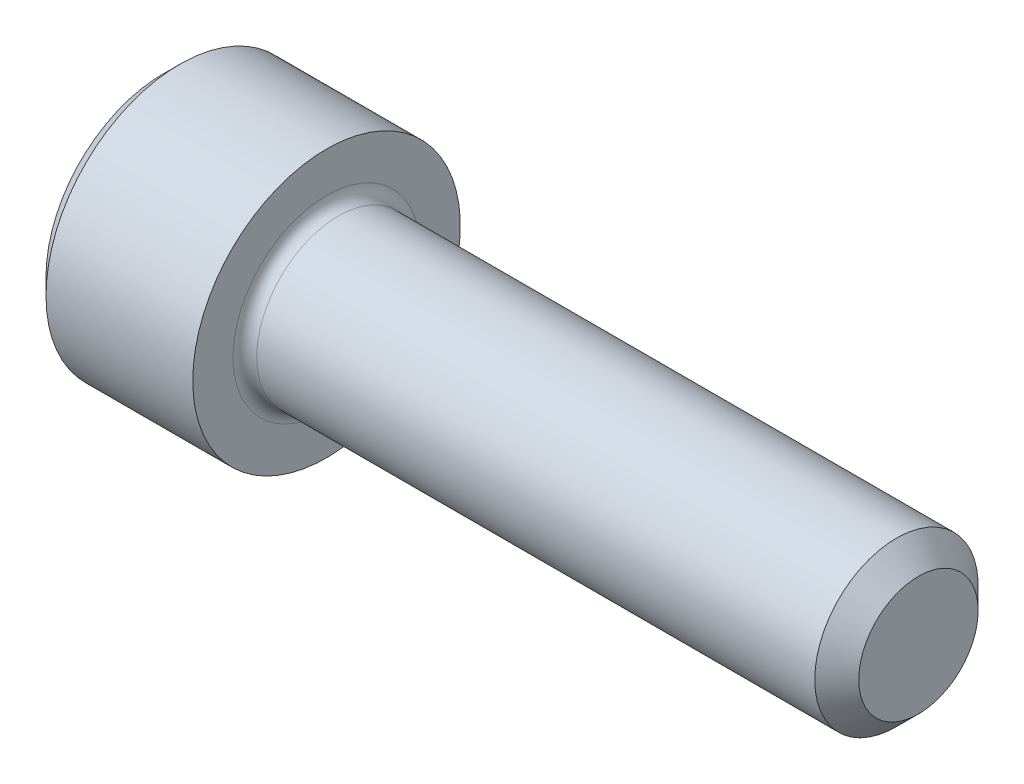
ISO-10303-21;
HEADER;
FILE_DESCRIPTION(('STEP AP214'),'2;1');
FILE_NAME('part.step','',(''),(''),'','','');
FILE_SCHEMA(('AUTOMOTIVE_DESIGN { 1 0 10303 214 1 1 1 1 }'));
ENDSEC;
DATA;
#1=APPLICATION_CONTEXT('core data for automotive mechanical design processes');
#2=APPLICATION_PROTOCOL_DEFINITION('international standard','automotive_design',2000,#1);
#3=PRODUCT_CONTEXT('',#1,'mechanical');
#4=PRODUCT('Part','Part','',(#3));
#5=PRODUCT_RELATED_PRODUCT_CATEGORY('part','',(#4));
#6=PRODUCT_DEFINITION_FORMATION('','',#4);
#7=PRODUCT_DEFINITION_CONTEXT('part definition',#1,'design');
#8=PRODUCT_DEFINITION('design','',#6,#7);
#9=PRODUCT_DEFINITION_SHAPE('','',#8);
#10=(LENGTH_UNIT() NAMED_UNIT(*) SI_UNIT(.MILLI.,.METRE.));
#11=(NAMED_UNIT(*) PLANE_ANGLE_UNIT() SI_UNIT($,.RADIAN.));
#12=(NAMED_UNIT(*) SI_UNIT($,.STERADIAN.) SOLID_ANGLE_UNIT());
#13=UNCERTAINTY_MEASURE_WITH_UNIT(LENGTH_MEASURE(1.E-05),#10,'distance_accuracy_value','');
#14=(GEOMETRIC_REPRESENTATION_CONTEXT(3) GLOBAL_UNCERTAINTY_ASSIGNED_CONTEXT((#13)) GLOBAL_UNIT_ASSIGNED_CONTEXT((#10,
#11,#12)) REPRESENTATION_CONTEXT('',''));
#15=CARTESIAN_POINT('',(0.,0.,0.));
#16=DIRECTION('',(0.,0.,1.));
#17=DIRECTION('',(1.,0.,0.));
#18=AXIS2_PLACEMENT_3D('',#15,#16,#17);
#19=CARTESIAN_POINT('',(0.,0.,0.));
#20=DIRECTION('',(-1.,0.,0.));
#21=DIRECTION('',(0.,0.,1.));
#22=AXIS2_PLACEMENT_3D('',#19,#20,#21);
#23=PLANE('',#22);
#24=DIRECTION('',(0.,-0.499999999999999,0.866025403784439));
#25=VECTOR('',#24,1.);
#26=CARTESIAN_POINT('',(0.,1.5984519552784,0.));
#27=LINE('',#26,#25);
#28=CARTESIAN_POINT('',(0.,1.5984519552784,0.));
#29=VERTEX_POINT('',#28);
#30=CARTESIAN_POINT('',(0.,0.799225977639205,1.3843));
#31=VERTEX_POINT('',#30);
#32=EDGE_CURVE('E257',#29,#31,#27,.T.);
#33=ORIENTED_EDGE('',*,*,#32,.T.);
#34=DIRECTION('',(0.,1.,0.));
#35=VECTOR('',#34,1.);
#36=CARTESIAN_POINT('',(0.,-0.799225977639191,1.3843));
#37=LINE('',#36,#35);
#38=CARTESIAN_POINT('',(0.,-0.799225977639191,1.3843));
#39=VERTEX_POINT('',#38);
#40=EDGE_CURVE('E128',#39,#31,#37,.T.);
#41=ORIENTED_EDGE('',*,*,#40,.F.);
#42=DIRECTION('',(0.,-0.500000000000001,-0.866025403784438));
#43=VECTOR('',#42,1.);
#44=CARTESIAN_POINT('',(0.,-0.799225977639191,1.3843));
#45=LINE('',#44,#43);
#46=CARTESIAN_POINT('',(0.,-1.59845195527839,0.));
#47=VERTEX_POINT('',#46);
#48=EDGE_CURVE('E260',#39,#47,#45,.T.);
#49=ORIENTED_EDGE('',*,*,#48,.T.);
#50=DIRECTION('',(0.,0.499999999999999,-0.86602540378444));
#51=VECTOR('',#50,1.);
#52=CARTESIAN_POINT('',(0.,-1.59845195527839,0.));
#53=LINE('',#52,#51);
#54=CARTESIAN_POINT('',(0.,-0.799225977639196,-1.3843));
#55=VERTEX_POINT('',#54);
#56=EDGE_CURVE('E263',#47,#55,#53,.T.);
#57=ORIENTED_EDGE('',*,*,#56,.T.);
#58=DIRECTION('',(0.,-1.,0.));
#59=VECTOR('',#58,1.);
#60=CARTESIAN_POINT('',(0.,0.799225977639202,-1.3843));
#61=LINE('',#60,#59);
#62=CARTESIAN_POINT('',(0.,0.799225977639202,-1.3843));
#63=VERTEX_POINT('',#62);
#64=EDGE_CURVE('E266',#63,#55,#61,.T.);
#65=ORIENTED_EDGE('',*,*,#64,.F.);
#66=DIRECTION('',(0.,-0.500000000000001,-0.866025403784438));
#67=VECTOR('',#66,1.);
#68=CARTESIAN_POINT('',(0.,1.5984519552784,0.));
#69=LINE('',#68,#67);
#70=EDGE_CURVE('E123',#29,#63,#69,.T.);
#71=ORIENTED_EDGE('',*,*,#70,.F.);
#72=EDGE_LOOP('',(#33,#41,#49,#57,#65,#71));
#73=FACE_BOUND('',#72,.T.);
#74=CARTESIAN_POINT('',(0.,0.,0.));
#75=DIRECTION('',(-1.,0.,0.));
#76=DIRECTION('',(0.,0.,1.));
#77=AXIS2_PLACEMENT_3D('',#74,#75,#76);
#78=CIRCLE('',#77,2.51460000000001);
#79=CARTESIAN_POINT('',(0.,0.,2.51460000000001));
#80=VERTEX_POINT('',#79);
#81=EDGE_CURVE('E152',#80,#80,#78,.T.);
#82=ORIENTED_EDGE('',*,*,#81,.T.);
#83=EDGE_LOOP('',(#82));
#84=FACE_BOUND('',#83,.T.);
#85=ADVANCED_FACE('F32',(#73,#84),#23,.T.);
#86=CARTESIAN_POINT('',(0.,0.,0.));
#87=DIRECTION('',(1.,0.,0.));
#88=DIRECTION('',(0.,0.,-1.));
#89=AXIS2_PLACEMENT_3D('',#86,#87,#88);
#90=CONICAL_SURFACE('',#89,2.51460000000001,0.785398163397436);
#91=CARTESIAN_POINT('',(0.355600000000005,0.,0.));
#92=DIRECTION('',(-1.,0.,0.));
#93=DIRECTION('',(0.,0.,1.));
#94=AXIS2_PLACEMENT_3D('',#91,#92,#93);
#95=CIRCLE('',#94,2.8702);
#96=CARTESIAN_POINT('',(0.355600000000005,0.,2.8702));
#97=VERTEX_POINT('',#96);
#98=EDGE_CURVE('E149',#97,#97,#95,.T.);
#99=ORIENTED_EDGE('',*,*,#98,.T.);
#100=EDGE_LOOP('',(#99));
#101=FACE_BOUND('',#100,.T.);
#102=ORIENTED_EDGE('',*,*,#81,.F.);
#103=EDGE_LOOP('',(#102));
#104=FACE_BOUND('',#103,.T.);
#105=ADVANCED_FACE('F173',(#101,#104),#90,.T.);
#106=CARTESIAN_POINT('',(-31.75,0.,0.));
#107=DIRECTION('',(-1.,0.,0.));
#108=DIRECTION('',(0.,0.,1.));
#109=AXIS2_PLACEMENT_3D('',#106,#107,#108);
#110=CYLINDRICAL_SURFACE('',#109,2.8702);
#111=CARTESIAN_POINT('',(3.5052,0.,0.));
#112=DIRECTION('',(-1.,0.,0.));
#113=DIRECTION('',(0.,0.,1.));
#114=AXIS2_PLACEMENT_3D('',#111,#112,#113);
#115=CIRCLE('',#114,2.8702);
#116=CARTESIAN_POINT('',(3.5052,0.,2.8702));
#117=VERTEX_POINT('',#116);
#118=EDGE_CURVE('E146',#117,#117,#115,.T.);
#119=ORIENTED_EDGE('',*,*,#118,.T.);
#120=EDGE_LOOP('',(#119));
#121=FACE_BOUND('',#120,.T.);
#122=ORIENTED_EDGE('',*,*,#98,.F.);
#123=EDGE_LOOP('',(#122));
#124=FACE_BOUND('',#123,.T.);
#125=ADVANCED_FACE('F178',(#121,#124),#110,.T.);
#126=CARTESIAN_POINT('',(3.5052,2.8702,0.));
#127=DIRECTION('',(1.,0.,0.));
#128=DIRECTION('',(0.,0.,-1.));
#129=AXIS2_PLACEMENT_3D('',#126,#127,#128);
#130=PLANE('',#129);
#131=CARTESIAN_POINT('',(3.5052,0.,0.));
#132=DIRECTION('',(1.,0.,0.));
#133=DIRECTION('',(0.,0.,-1.));
#134=AXIS2_PLACEMENT_3D('',#131,#132,#133);
#135=CIRCLE('',#134,2.0066);
#136=CARTESIAN_POINT('',(3.5052,0.,-2.0066));
#137=VERTEX_POINT('',#136);
#138=EDGE_CURVE('E40',#137,#137,#135,.F.);
#139=ORIENTED_EDGE('',*,*,#138,.T.);
#140=EDGE_LOOP('',(#139));
#141=FACE_BOUND('',#140,.T.);
#142=ORIENTED_EDGE('',*,*,#118,.F.);
#143=EDGE_LOOP('',(#142));
#144=FACE_BOUND('',#143,.T.);
#145=ADVANCED_FACE('F157',(#141,#144),#130,.T.);
#146=CARTESIAN_POINT('',(-31.75,0.,0.));
#147=DIRECTION('',(-1.,0.,0.));
#148=DIRECTION('',(0.,0.,1.));
#149=AXIS2_PLACEMENT_3D('',#146,#147,#148);
#150=CYLINDRICAL_SURFACE('',#149,1.7526);
#151=CARTESIAN_POINT('',(3.7592,0.,0.));
#152=DIRECTION('',(1.,0.,0.));
#153=DIRECTION('',(0.,0.,-1.));
#154=AXIS2_PLACEMENT_3D('',#151,#152,#153);
#155=CIRCLE('',#154,1.7526);
#156=CARTESIAN_POINT('',(3.7592,0.,-1.7526));
#157=VERTEX_POINT('',#156);
#158=EDGE_CURVE('E11',#157,#157,#155,.T.);
#159=ORIENTED_EDGE('',*,*,#158,.T.);
#160=EDGE_LOOP('',(#159));
#161=FACE_BOUND('',#160,.T.);
#162=CARTESIAN_POINT('',(15.73276,0.,0.));
#163=DIRECTION('',(-1.,0.,0.));
#164=DIRECTION('',(0.,0.,1.));
#165=AXIS2_PLACEMENT_3D('',#162,#163,#164);
#166=CIRCLE('',#165,1.7526);
#167=CARTESIAN_POINT('',(15.73276,0.,1.7526));
#168=VERTEX_POINT('',#167);
#169=EDGE_CURVE('E143',#168,#168,#166,.T.);
#170=ORIENTED_EDGE('',*,*,#169,.T.);
#171=EDGE_LOOP('',(#170));
#172=FACE_BOUND('',#171,.T.);
#173=ADVANCED_FACE('F188',(#161,#172),#150,.T.);
#174=CARTESIAN_POINT('',(16.2052,0.,0.));
#175=DIRECTION('',(-1.,0.,0.));
#176=DIRECTION('',(0.,0.,1.));
#177=AXIS2_PLACEMENT_3D('',#174,#175,#176);
#178=CONICAL_SURFACE('',#177,1.28016,0.785398163397457);
#179=ORIENTED_EDGE('',*,*,#169,.F.);
#180=EDGE_LOOP('',(#179));
#181=FACE_BOUND('',#180,.T.);
#182=CARTESIAN_POINT('',(16.2052,0.,0.));
#183=DIRECTION('',(-1.,0.,0.));
#184=DIRECTION('',(0.,0.,1.));
#185=AXIS2_PLACEMENT_3D('',#182,#183,#184);
#186=CIRCLE('',#185,1.28016);
#187=CARTESIAN_POINT('',(16.2052,0.,1.28016));
#188=VERTEX_POINT('',#187);
#189=EDGE_CURVE('E139',#188,#188,#186,.T.);
#190=ORIENTED_EDGE('',*,*,#189,.T.);
#191=EDGE_LOOP('',(#190));
#192=FACE_BOUND('',#191,.T.);
#193=ADVANCED_FACE('F168',(#181,#192),#178,.T.);
#194=CARTESIAN_POINT('',(16.2052,1.28016,0.));
#195=DIRECTION('',(1.,0.,0.));
#196=DIRECTION('',(0.,0.,-1.));
#197=AXIS2_PLACEMENT_3D('',#194,#195,#196);
#198=PLANE('',#197);
#199=ORIENTED_EDGE('',*,*,#189,.F.);
#200=EDGE_LOOP('',(#199));
#201=FACE_BOUND('',#200,.T.);
#202=ADVANCED_FACE('F161',(#201),#198,.T.);
#203=CARTESIAN_POINT('',(3.7592,0.,0.));
#204=DIRECTION('',(1.,0.,0.));
#205=DIRECTION('',(0.,0.,-1.));
#206=AXIS2_PLACEMENT_3D('',#203,#204,#205);
#207=TOROIDAL_SURFACE('',#206,2.0066,0.254);
#208=ORIENTED_EDGE('',*,*,#158,.F.);
#209=EDGE_LOOP('',(#208));
#210=FACE_BOUND('',#209,.T.);
#211=ORIENTED_EDGE('',*,*,#138,.F.);
#212=EDGE_LOOP('',(#211));
#213=FACE_BOUND('',#212,.T.);
#214=ADVANCED_FACE('F34',(#210,#213),#207,.F.);
#215=CARTESIAN_POINT('',(1.6256,1.5984519552784,0.));
#216=DIRECTION('',(0.,-0.866025403784439,-0.499999999999999));
#217=DIRECTION('',(0.,0.499999999999999,-0.866025403784439));
#218=AXIS2_PLACEMENT_3D('',#215,#216,#217);
#219=PLANE('',#218);
#220=ORIENTED_EDGE('',*,*,#32,.F.);
#221=DIRECTION('',(-1.,0.,0.));
#222=VECTOR('',#221,1.);
#223=CARTESIAN_POINT('',(1.6256,1.5984519552784,0.));
#224=LINE('',#223,#222);
#225=CARTESIAN_POINT('',(1.6256,1.5984519552784,0.));
#226=VERTEX_POINT('',#225);
#227=EDGE_CURVE('E247',#226,#29,#224,.T.);
#228=ORIENTED_EDGE('',*,*,#227,.F.);
#229=DIRECTION('',(0.,-0.499999999999999,0.866025403784439));
#230=VECTOR('',#229,1.);
#231=CARTESIAN_POINT('',(1.6256,1.5984519552784,0.));
#232=LINE('',#231,#230);
#233=CARTESIAN_POINT('',(1.6256,1.1988389664588,0.692150000000001));
#234=VERTEX_POINT('',#233);
#235=EDGE_CURVE('E115',#226,#234,#232,.T.);
#236=ORIENTED_EDGE('',*,*,#235,.T.);
#237=CARTESIAN_POINT('',(1.6256,0.799225977639205,1.3843));
#238=VERTEX_POINT('',#237);
#239=EDGE_CURVE('E106',#234,#238,#232,.T.);
#240=ORIENTED_EDGE('',*,*,#239,.T.);
#241=DIRECTION('',(-1.,0.,0.));
#242=VECTOR('',#241,1.);
#243=CARTESIAN_POINT('',(1.6256,0.799225977639205,1.3843));
#244=LINE('',#243,#242);
#245=EDGE_CURVE('E120',#238,#31,#244,.T.);
#246=ORIENTED_EDGE('',*,*,#245,.T.);
#247=EDGE_LOOP('',(#220,#228,#236,#240,#246));
#248=FACE_BOUND('',#247,.T.);
#249=ADVANCED_FACE('F119',(#248),#219,.T.);
#250=CARTESIAN_POINT('',(1.6256,-0.799225977639191,1.3843));
#251=DIRECTION('',(0.,0.,1.));
#252=DIRECTION('',(0.,-1.,0.));
#253=AXIS2_PLACEMENT_3D('',#250,#251,#252);
#254=PLANE('',#253);
#255=ORIENTED_EDGE('',*,*,#40,.T.);
#256=ORIENTED_EDGE('',*,*,#245,.F.);
#257=DIRECTION('',(0.,1.,0.));
#258=VECTOR('',#257,1.);
#259=CARTESIAN_POINT('',(1.6256,-0.799225977639191,1.3843));
#260=LINE('',#259,#258);
#261=CARTESIAN_POINT('',(1.6256,0.,1.3843));
#262=VERTEX_POINT('',#261);
#263=EDGE_CURVE('E103',#262,#238,#260,.T.);
#264=ORIENTED_EDGE('',*,*,#263,.F.);
#265=CARTESIAN_POINT('',(1.6256,-0.799225977639191,1.3843));
#266=VERTEX_POINT('',#265);
#267=EDGE_CURVE('E114',#266,#262,#260,.T.);
#268=ORIENTED_EDGE('',*,*,#267,.F.);
#269=DIRECTION('',(-1.,0.,0.));
#270=VECTOR('',#269,1.);
#271=CARTESIAN_POINT('',(1.6256,-0.799225977639191,1.3843));
#272=LINE('',#271,#270);
#273=EDGE_CURVE('E130',#266,#39,#272,.T.);
#274=ORIENTED_EDGE('',*,*,#273,.T.);
#275=EDGE_LOOP('',(#255,#256,#264,#268,#274));
#276=FACE_BOUND('',#275,.T.);
#277=ADVANCED_FACE('F125',(#276),#254,.F.);
#278=CARTESIAN_POINT('',(1.6256,-0.799225977639191,1.3843));
#279=DIRECTION('',(0.,0.866025403784438,-0.500000000000001));
#280=DIRECTION('',(0.,0.500000000000001,0.866025403784438));
#281=AXIS2_PLACEMENT_3D('',#278,#279,#280);
#282=PLANE('',#281);
#283=ORIENTED_EDGE('',*,*,#48,.F.);
#284=ORIENTED_EDGE('',*,*,#273,.F.);
#285=DIRECTION('',(0.,-0.500000000000001,-0.866025403784438));
#286=VECTOR('',#285,1.);
#287=CARTESIAN_POINT('',(1.6256,-0.799225977639191,1.3843));
#288=LINE('',#287,#286);
#289=CARTESIAN_POINT('',(1.6256,-1.19883896645879,0.692149999999999));
#290=VERTEX_POINT('',#289);
#291=EDGE_CURVE('E286',#266,#290,#288,.T.);
#292=ORIENTED_EDGE('',*,*,#291,.T.);
#293=CARTESIAN_POINT('',(1.6256,-1.59845195527839,0.));
#294=VERTEX_POINT('',#293);
#295=EDGE_CURVE('E275',#290,#294,#288,.T.);
#296=ORIENTED_EDGE('',*,*,#295,.T.);
#297=DIRECTION('',(-1.,0.,0.));
#298=VECTOR('',#297,1.);
#299=CARTESIAN_POINT('',(1.6256,-1.59845195527839,0.));
#300=LINE('',#299,#298);
#301=EDGE_CURVE('E135',#294,#47,#300,.T.);
#302=ORIENTED_EDGE('',*,*,#301,.T.);
#303=EDGE_LOOP('',(#283,#284,#292,#296,#302));
#304=FACE_BOUND('',#303,.T.);
#305=ADVANCED_FACE('F201',(#304),#282,.T.);
#306=CARTESIAN_POINT('',(1.6256,-1.59845195527839,0.));
#307=DIRECTION('',(0.,0.866025403784439,0.499999999999999));
#308=DIRECTION('',(0.,-0.499999999999999,0.866025403784439));
#309=AXIS2_PLACEMENT_3D('',#306,#307,#308);
#310=PLANE('',#309);
#311=ORIENTED_EDGE('',*,*,#56,.F.);
#312=ORIENTED_EDGE('',*,*,#301,.F.);
#313=DIRECTION('',(0.,0.499999999999999,-0.86602540378444));
#314=VECTOR('',#313,1.);
#315=CARTESIAN_POINT('',(1.6256,-1.59845195527839,0.));
#316=LINE('',#315,#314);
#317=CARTESIAN_POINT('',(1.6256,-1.1988389664588,-0.692149999999996));
#318=VERTEX_POINT('',#317);
#319=EDGE_CURVE('E253',#294,#318,#316,.T.);
#320=ORIENTED_EDGE('',*,*,#319,.T.);
#321=CARTESIAN_POINT('',(1.6256,-0.799225977639196,-1.3843));
#322=VERTEX_POINT('',#321);
#323=EDGE_CURVE('E285',#318,#322,#316,.T.);
#324=ORIENTED_EDGE('',*,*,#323,.T.);
#325=DIRECTION('',(-1.,0.,0.));
#326=VECTOR('',#325,1.);
#327=CARTESIAN_POINT('',(1.6256,-0.799225977639196,-1.3843));
#328=LINE('',#327,#326);
#329=EDGE_CURVE('E246',#322,#55,#328,.T.);
#330=ORIENTED_EDGE('',*,*,#329,.T.);
#331=EDGE_LOOP('',(#311,#312,#320,#324,#330));
#332=FACE_BOUND('',#331,.T.);
#333=ADVANCED_FACE('F204',(#332),#310,.T.);
#334=CARTESIAN_POINT('',(1.6256,0.799225977639202,-1.3843));
#335=DIRECTION('',(0.,0.,-1.));
#336=DIRECTION('',(0.,1.,0.));
#337=AXIS2_PLACEMENT_3D('',#334,#335,#336);
#338=PLANE('',#337);
#339=ORIENTED_EDGE('',*,*,#64,.T.);
#340=ORIENTED_EDGE('',*,*,#329,.F.);
#341=DIRECTION('',(0.,-1.,0.));
#342=VECTOR('',#341,1.);
#343=CARTESIAN_POINT('',(1.6256,0.799225977639202,-1.3843));
#344=LINE('',#343,#342);
#345=CARTESIAN_POINT('',(1.6256,0.,-1.3843));
#346=VERTEX_POINT('',#345);
#347=EDGE_CURVE('E250',#346,#322,#344,.T.);
#348=ORIENTED_EDGE('',*,*,#347,.F.);
#349=CARTESIAN_POINT('',(1.6256,0.799225977639202,-1.3843));
#350=VERTEX_POINT('',#349);
#351=EDGE_CURVE('E47',#350,#346,#344,.T.);
#352=ORIENTED_EDGE('',*,*,#351,.F.);
#353=DIRECTION('',(-1.,0.,0.));
#354=VECTOR('',#353,1.);
#355=CARTESIAN_POINT('',(1.6256,0.799225977639202,-1.3843));
#356=LINE('',#355,#354);
#357=EDGE_CURVE('E243',#350,#63,#356,.T.);
#358=ORIENTED_EDGE('',*,*,#357,.T.);
#359=EDGE_LOOP('',(#339,#340,#348,#352,#358));
#360=FACE_BOUND('',#359,.T.);
#361=ADVANCED_FACE('F208',(#360),#338,.F.);
#362=CARTESIAN_POINT('',(1.6256,1.5984519552784,0.));
#363=DIRECTION('',(0.,0.866025403784438,-0.500000000000001));
#364=DIRECTION('',(0.,0.500000000000001,0.866025403784438));
#365=AXIS2_PLACEMENT_3D('',#362,#363,#364);
#366=PLANE('',#365);
#367=ORIENTED_EDGE('',*,*,#70,.T.);
#368=ORIENTED_EDGE('',*,*,#357,.F.);
#369=DIRECTION('',(0.,-0.500000000000001,-0.866025403784438));
#370=VECTOR('',#369,1.);
#371=CARTESIAN_POINT('',(1.6256,1.5984519552784,0.));
#372=LINE('',#371,#370);
#373=CARTESIAN_POINT('',(1.6256,1.1988389664588,-0.692150000000004));
#374=VERTEX_POINT('',#373);
#375=EDGE_CURVE('E233',#374,#350,#372,.T.);
#376=ORIENTED_EDGE('',*,*,#375,.F.);
#377=EDGE_CURVE('E239',#226,#374,#372,.T.);
#378=ORIENTED_EDGE('',*,*,#377,.F.);
#379=ORIENTED_EDGE('',*,*,#227,.T.);
#380=EDGE_LOOP('',(#367,#368,#376,#378,#379));
#381=FACE_BOUND('',#380,.T.);
#382=ADVANCED_FACE('F212',(#381),#366,.F.);
#383=CARTESIAN_POINT('',(1.6256,0.,2.7686));
#384=DIRECTION('',(1.,0.,0.));
#385=DIRECTION('',(0.,0.,-1.));
#386=AXIS2_PLACEMENT_3D('',#383,#384,#385);
#387=PLANE('',#386);
#388=ORIENTED_EDGE('',*,*,#347,.T.);
#389=ORIENTED_EDGE('',*,*,#323,.F.);
#390=CARTESIAN_POINT('',(1.6256,0.,0.));
#391=DIRECTION('',(-1.,0.,0.));
#392=DIRECTION('',(0.,0.,1.));
#393=AXIS2_PLACEMENT_3D('',#390,#391,#392);
#394=CIRCLE('',#393,1.3843);
#395=EDGE_CURVE('E281',#346,#318,#394,.T.);
#396=ORIENTED_EDGE('',*,*,#395,.F.);
#397=EDGE_LOOP('',(#388,#389,#396));
#398=FACE_BOUND('',#397,.T.);
#399=ADVANCED_FACE('F216',(#398),#387,.F.);
#400=ORIENTED_EDGE('',*,*,#319,.F.);
#401=ORIENTED_EDGE('',*,*,#295,.F.);
#402=EDGE_CURVE('E133',#318,#290,#394,.T.);
#403=ORIENTED_EDGE('',*,*,#402,.F.);
#404=EDGE_LOOP('',(#400,#401,#403));
#405=FACE_BOUND('',#404,.T.);
#406=ADVANCED_FACE('F219',(#405),#387,.F.);
#407=ORIENTED_EDGE('',*,*,#291,.F.);
#408=ORIENTED_EDGE('',*,*,#267,.T.);
#409=EDGE_CURVE('E129',#290,#262,#394,.T.);
#410=ORIENTED_EDGE('',*,*,#409,.F.);
#411=EDGE_LOOP('',(#407,#408,#410));
#412=FACE_BOUND('',#411,.T.);
#413=ADVANCED_FACE('F224',(#412),#387,.F.);
#414=ORIENTED_EDGE('',*,*,#263,.T.);
#415=ORIENTED_EDGE('',*,*,#239,.F.);
#416=EDGE_CURVE('E109',#262,#234,#394,.T.);
#417=ORIENTED_EDGE('',*,*,#416,.F.);
#418=EDGE_LOOP('',(#414,#415,#417));
#419=FACE_BOUND('',#418,.T.);
#420=ADVANCED_FACE('F105',(#419),#387,.F.);
#421=ORIENTED_EDGE('',*,*,#235,.F.);
#422=ORIENTED_EDGE('',*,*,#377,.T.);
#423=EDGE_CURVE('E140',#234,#374,#394,.T.);
#424=ORIENTED_EDGE('',*,*,#423,.F.);
#425=EDGE_LOOP('',(#421,#422,#424));
#426=FACE_BOUND('',#425,.T.);
#427=ADVANCED_FACE('F227',(#426),#387,.F.);
#428=ORIENTED_EDGE('',*,*,#375,.T.);
#429=ORIENTED_EDGE('',*,*,#351,.T.);
#430=EDGE_CURVE('E236',#374,#346,#394,.T.);
#431=ORIENTED_EDGE('',*,*,#430,.F.);
#432=EDGE_LOOP('',(#428,#429,#431));
#433=FACE_BOUND('',#432,.T.);
#434=ADVANCED_FACE('F197',(#433),#387,.F.);
#435=CARTESIAN_POINT('',(1.6256,0.,0.));
#436=DIRECTION('',(-1.,0.,0.));
#437=DIRECTION('',(0.,0.,1.));
#438=AXIS2_PLACEMENT_3D('',#435,#436,#437);
#439=CONICAL_SURFACE('',#438,1.3843,1.04719755119659);
#440=CARTESIAN_POINT('',(2.4248259776392,0.,0.));
#441=VERTEX_POINT('',#440);
#442=VERTEX_LOOP('',#441);
#443=FACE_BOUND('',#442,.T.);
#444=ORIENTED_EDGE('',*,*,#416,.T.);
#445=ORIENTED_EDGE('',*,*,#423,.T.);
#446=ORIENTED_EDGE('',*,*,#430,.T.);
#447=ORIENTED_EDGE('',*,*,#395,.T.);
#448=ORIENTED_EDGE('',*,*,#402,.T.);
#449=ORIENTED_EDGE('',*,*,#409,.T.);
#450=EDGE_LOOP('',(#444,#445,#446,#447,#448,#449));
#451=FACE_BOUND('',#450,.T.);
#452=ADVANCED_FACE('F195',(#443,#451),#439,.F.);
#453=CLOSED_SHELL('',(#85,#105,#125,#145,#173,#193,#202,#214,#249,#277,#305,#333,#361,#382,#399,
#406,#413,#420,#427,#434,#452));
#454=MANIFOLD_SOLID_BREP('B2',#453);
#455=ADVANCED_BREP_SHAPE_REPRESENTATION('',(#18,#454),#14);
#456=SHAPE_DEFINITION_REPRESENTATION(#9,#455);
ENDSEC;
END-ISO-10303-21;
